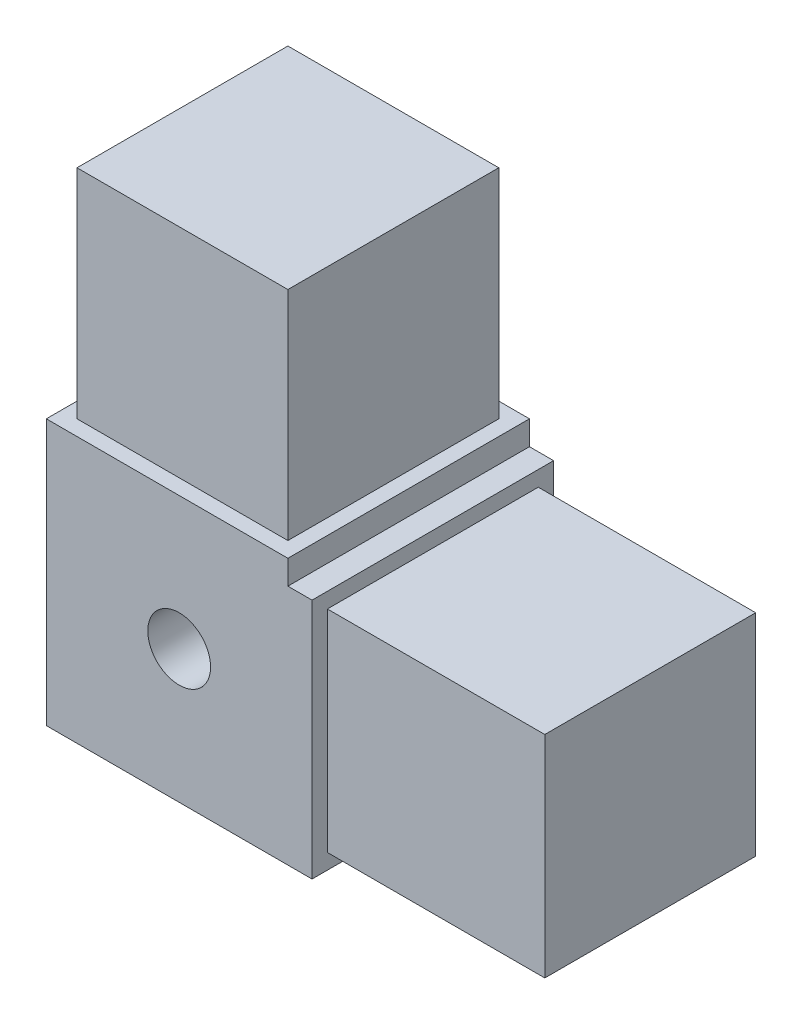
ISO-10303-21;
HEADER;
FILE_DESCRIPTION(('STEP AP214'),'2;1');
FILE_NAME('part.step','',(''),(''),'','','');
FILE_SCHEMA(('AUTOMOTIVE_DESIGN { 1 0 10303 214 1 1 1 1 }'));
ENDSEC;
DATA;
#1=APPLICATION_CONTEXT('core data for automotive mechanical design processes');
#2=APPLICATION_PROTOCOL_DEFINITION('international standard','automotive_design',2000,#1);
#3=PRODUCT_CONTEXT('',#1,'mechanical');
#4=PRODUCT('Part','Part','',(#3));
#5=PRODUCT_RELATED_PRODUCT_CATEGORY('part','',(#4));
#6=PRODUCT_DEFINITION_FORMATION('','',#4);
#7=PRODUCT_DEFINITION_CONTEXT('part definition',#1,'design');
#8=PRODUCT_DEFINITION('design','',#6,#7);
#9=PRODUCT_DEFINITION_SHAPE('','',#8);
#10=(LENGTH_UNIT() NAMED_UNIT(*) SI_UNIT(.MILLI.,.METRE.));
#11=(NAMED_UNIT(*) PLANE_ANGLE_UNIT() SI_UNIT($,.RADIAN.));
#12=(NAMED_UNIT(*) SI_UNIT($,.STERADIAN.) SOLID_ANGLE_UNIT());
#13=UNCERTAINTY_MEASURE_WITH_UNIT(LENGTH_MEASURE(1.E-05),#10,'distance_accuracy_value','');
#14=(GEOMETRIC_REPRESENTATION_CONTEXT(3) GLOBAL_UNCERTAINTY_ASSIGNED_CONTEXT((#13)) GLOBAL_UNIT_ASSIGNED_CONTEXT((#10,
#11,#12)) REPRESENTATION_CONTEXT('',''));
#15=CARTESIAN_POINT('',(0.,0.,0.));
#16=DIRECTION('',(0.,0.,1.));
#17=DIRECTION('',(1.,0.,0.));
#18=AXIS2_PLACEMENT_3D('',#15,#16,#17);
#19=CARTESIAN_POINT('',(-25.4,-25.4,-12.7));
#20=DIRECTION('',(1.,0.,0.));
#21=DIRECTION('',(0.,0.,1.));
#22=AXIS2_PLACEMENT_3D('',#19,#20,#21);
#23=PLANE('',#22);
#24=DIRECTION('',(0.,0.,-1.));
#25=VECTOR('',#24,1.);
#26=CARTESIAN_POINT('',(-25.4,2.54,-12.7));
#27=LINE('',#26,#25);
#28=CARTESIAN_POINT('',(-25.4,2.54,12.7));
#29=VERTEX_POINT('',#28);
#30=CARTESIAN_POINT('',(-25.4,2.54,-12.7));
#31=VERTEX_POINT('',#30);
#32=EDGE_CURVE('E183',#29,#31,#27,.T.);
#33=ORIENTED_EDGE('',*,*,#32,.T.);
#34=DIRECTION('',(0.,-1.,0.));
#35=VECTOR('',#34,1.);
#36=CARTESIAN_POINT('',(-25.4,-25.4,-12.7));
#37=LINE('',#36,#35);
#38=CARTESIAN_POINT('',(-25.4,-25.4,-12.7));
#39=VERTEX_POINT('',#38);
#40=EDGE_CURVE('E247',#31,#39,#37,.T.);
#41=ORIENTED_EDGE('',*,*,#40,.T.);
#42=DIRECTION('',(0.,0.,1.));
#43=VECTOR('',#42,1.);
#44=CARTESIAN_POINT('',(-25.4,-25.4,-12.7));
#45=LINE('',#44,#43);
#46=CARTESIAN_POINT('',(-25.4,-25.4,12.7));
#47=VERTEX_POINT('',#46);
#48=EDGE_CURVE('E11',#39,#47,#45,.T.);
#49=ORIENTED_EDGE('',*,*,#48,.T.);
#50=DIRECTION('',(0.,-1.,0.));
#51=VECTOR('',#50,1.);
#52=CARTESIAN_POINT('',(-25.4,-25.4,12.7));
#53=LINE('',#52,#51);
#54=EDGE_CURVE('E246',#29,#47,#53,.T.);
#55=ORIENTED_EDGE('',*,*,#54,.F.);
#56=EDGE_LOOP('',(#33,#41,#49,#55));
#57=FACE_BOUND('',#56,.T.);
#58=ADVANCED_FACE('F37',(#57),#23,.F.);
#59=CARTESIAN_POINT('',(0.,0.,-12.7));
#60=DIRECTION('',(0.,0.,1.));
#61=DIRECTION('',(-1.,0.,0.));
#62=AXIS2_PLACEMENT_3D('',#59,#60,#61);
#63=PLANE('',#62);
#64=CARTESIAN_POINT('',(-11.43,-11.43,-12.7));
#65=DIRECTION('',(0.,0.,1.));
#66=DIRECTION('',(1.,0.,0.));
#67=AXIS2_PLACEMENT_3D('',#64,#65,#66);
#68=CIRCLE('',#67,3.3);
#69=CARTESIAN_POINT('',(-8.13000000000001,-11.43,-12.7));
#70=VERTEX_POINT('',#69);
#71=EDGE_CURVE('E165',#70,#70,#68,.T.);
#72=ORIENTED_EDGE('',*,*,#71,.T.);
#73=EDGE_LOOP('',(#72));
#74=FACE_BOUND('',#73,.T.);
#75=DIRECTION('',(1.,0.,0.));
#76=VECTOR('',#75,1.);
#77=CARTESIAN_POINT('',(0.,2.54,-12.7));
#78=LINE('',#77,#76);
#79=CARTESIAN_POINT('',(0.,2.54,-12.7));
#80=VERTEX_POINT('',#79);
#81=EDGE_CURVE('E186',#31,#80,#78,.T.);
#82=ORIENTED_EDGE('',*,*,#81,.T.);
#83=DIRECTION('',(0.,-1.,0.));
#84=VECTOR('',#83,1.);
#85=CARTESIAN_POINT('',(0.,25.4,-12.7));
#86=LINE('',#85,#84);
#87=CARTESIAN_POINT('',(0.,0.,-12.7));
#88=VERTEX_POINT('',#87);
#89=EDGE_CURVE('E232',#80,#88,#86,.T.);
#90=ORIENTED_EDGE('',*,*,#89,.T.);
#91=DIRECTION('',(1.,0.,0.));
#92=VECTOR('',#91,1.);
#93=CARTESIAN_POINT('',(25.4,0.,-12.7));
#94=LINE('',#93,#92);
#95=CARTESIAN_POINT('',(2.53999999999999,0.,-12.7));
#96=VERTEX_POINT('',#95);
#97=EDGE_CURVE('E237',#88,#96,#94,.T.);
#98=ORIENTED_EDGE('',*,*,#97,.T.);
#99=DIRECTION('',(0.,-1.,0.));
#100=VECTOR('',#99,1.);
#101=CARTESIAN_POINT('',(2.53999999999999,-25.4,-12.7));
#102=LINE('',#101,#100);
#103=CARTESIAN_POINT('',(2.53999999999999,-25.4,-12.7));
#104=VERTEX_POINT('',#103);
#105=EDGE_CURVE('E214',#96,#104,#102,.T.);
#106=ORIENTED_EDGE('',*,*,#105,.T.);
#107=DIRECTION('',(1.,0.,0.));
#108=VECTOR('',#107,1.);
#109=CARTESIAN_POINT('',(-25.4,-25.4,-12.7));
#110=LINE('',#109,#108);
#111=EDGE_CURVE('E45',#39,#104,#110,.T.);
#112=ORIENTED_EDGE('',*,*,#111,.F.);
#113=ORIENTED_EDGE('',*,*,#40,.F.);
#114=EDGE_LOOP('',(#82,#90,#98,#106,#112,#113));
#115=FACE_BOUND('',#114,.T.);
#116=ADVANCED_FACE('F276',(#74,#115),#63,.F.);
#117=CARTESIAN_POINT('',(0.,0.,12.7));
#118=DIRECTION('',(0.,0.,1.));
#119=DIRECTION('',(-1.,0.,0.));
#120=AXIS2_PLACEMENT_3D('',#117,#118,#119);
#121=PLANE('',#120);
#122=CARTESIAN_POINT('',(-11.43,-11.43,12.7));
#123=DIRECTION('',(0.,0.,1.));
#124=DIRECTION('',(1.,0.,0.));
#125=AXIS2_PLACEMENT_3D('',#122,#123,#124);
#126=CIRCLE('',#125,3.3);
#127=CARTESIAN_POINT('',(-8.13000000000001,-11.43,12.7));
#128=VERTEX_POINT('',#127);
#129=EDGE_CURVE('E171',#128,#128,#126,.T.);
#130=ORIENTED_EDGE('',*,*,#129,.F.);
#131=EDGE_LOOP('',(#130));
#132=FACE_BOUND('',#131,.T.);
#133=ORIENTED_EDGE('',*,*,#54,.T.);
#134=DIRECTION('',(1.,0.,0.));
#135=VECTOR('',#134,1.);
#136=CARTESIAN_POINT('',(-25.4,-25.4,12.7));
#137=LINE('',#136,#135);
#138=CARTESIAN_POINT('',(2.53999999999999,-25.4,12.7));
#139=VERTEX_POINT('',#138);
#140=EDGE_CURVE('E250',#47,#139,#137,.T.);
#141=ORIENTED_EDGE('',*,*,#140,.T.);
#142=DIRECTION('',(0.,1.,0.));
#143=VECTOR('',#142,1.);
#144=CARTESIAN_POINT('',(2.53999999999999,-25.4,12.7));
#145=LINE('',#144,#143);
#146=CARTESIAN_POINT('',(2.53999999999999,0.,12.7));
#147=VERTEX_POINT('',#146);
#148=EDGE_CURVE('E227',#139,#147,#145,.T.);
#149=ORIENTED_EDGE('',*,*,#148,.T.);
#150=DIRECTION('',(1.,0.,0.));
#151=VECTOR('',#150,1.);
#152=CARTESIAN_POINT('',(25.4,0.,12.7));
#153=LINE('',#152,#151);
#154=CARTESIAN_POINT('',(0.,0.,12.7));
#155=VERTEX_POINT('',#154);
#156=EDGE_CURVE('E236',#155,#147,#153,.T.);
#157=ORIENTED_EDGE('',*,*,#156,.F.);
#158=DIRECTION('',(0.,-1.,0.));
#159=VECTOR('',#158,1.);
#160=CARTESIAN_POINT('',(0.,25.4,12.7));
#161=LINE('',#160,#159);
#162=CARTESIAN_POINT('',(0.,2.54,12.7));
#163=VERTEX_POINT('',#162);
#164=EDGE_CURVE('E233',#163,#155,#161,.T.);
#165=ORIENTED_EDGE('',*,*,#164,.F.);
#166=DIRECTION('',(-1.,0.,0.));
#167=VECTOR('',#166,1.);
#168=CARTESIAN_POINT('',(0.,2.54,12.7));
#169=LINE('',#168,#167);
#170=EDGE_CURVE('E181',#163,#29,#169,.T.);
#171=ORIENTED_EDGE('',*,*,#170,.T.);
#172=EDGE_LOOP('',(#133,#141,#149,#157,#165,#171));
#173=FACE_BOUND('',#172,.T.);
#174=ADVANCED_FACE('F256',(#132,#173),#121,.T.);
#175=CARTESIAN_POINT('',(0.,25.4,12.7));
#176=DIRECTION('',(-1.,0.,0.));
#177=DIRECTION('',(0.,0.,-1.));
#178=AXIS2_PLACEMENT_3D('',#175,#176,#177);
#179=PLANE('',#178);
#180=DIRECTION('',(0.,0.,1.));
#181=VECTOR('',#180,1.);
#182=CARTESIAN_POINT('',(0.,2.54,-12.7));
#183=LINE('',#182,#181);
#184=EDGE_CURVE('E60',#80,#163,#183,.T.);
#185=ORIENTED_EDGE('',*,*,#184,.T.);
#186=ORIENTED_EDGE('',*,*,#164,.T.);
#187=DIRECTION('',(0.,0.,-1.));
#188=VECTOR('',#187,1.);
#189=CARTESIAN_POINT('',(0.,0.,12.7));
#190=LINE('',#189,#188);
#191=EDGE_CURVE('E240',#155,#88,#190,.T.);
#192=ORIENTED_EDGE('',*,*,#191,.T.);
#193=ORIENTED_EDGE('',*,*,#89,.F.);
#194=EDGE_LOOP('',(#185,#186,#192,#193));
#195=FACE_BOUND('',#194,.T.);
#196=ADVANCED_FACE('F271',(#195),#179,.F.);
#197=CARTESIAN_POINT('',(-25.4,-25.4,-12.7));
#198=DIRECTION('',(0.,1.,0.));
#199=DIRECTION('',(0.,0.,-1.));
#200=AXIS2_PLACEMENT_3D('',#197,#198,#199);
#201=PLANE('',#200);
#202=ORIENTED_EDGE('',*,*,#140,.F.);
#203=ORIENTED_EDGE('',*,*,#48,.F.);
#204=ORIENTED_EDGE('',*,*,#111,.T.);
#205=DIRECTION('',(0.,0.,1.));
#206=VECTOR('',#205,1.);
#207=CARTESIAN_POINT('',(2.53999999999999,-25.4,-12.7));
#208=LINE('',#207,#206);
#209=EDGE_CURVE('E225',#104,#139,#208,.T.);
#210=ORIENTED_EDGE('',*,*,#209,.T.);
#211=EDGE_LOOP('',(#202,#203,#204,#210));
#212=FACE_BOUND('',#211,.T.);
#213=ADVANCED_FACE('F262',(#212),#201,.F.);
#214=CARTESIAN_POINT('',(25.4,0.,12.7));
#215=DIRECTION('',(0.,-1.,0.));
#216=DIRECTION('',(0.,0.,1.));
#217=AXIS2_PLACEMENT_3D('',#214,#215,#216);
#218=PLANE('',#217);
#219=ORIENTED_EDGE('',*,*,#97,.F.);
#220=ORIENTED_EDGE('',*,*,#191,.F.);
#221=ORIENTED_EDGE('',*,*,#156,.T.);
#222=DIRECTION('',(0.,0.,-1.));
#223=VECTOR('',#222,1.);
#224=CARTESIAN_POINT('',(2.53999999999999,0.,-12.7));
#225=LINE('',#224,#223);
#226=EDGE_CURVE('E230',#147,#96,#225,.T.);
#227=ORIENTED_EDGE('',*,*,#226,.T.);
#228=EDGE_LOOP('',(#219,#220,#221,#227));
#229=FACE_BOUND('',#228,.T.);
#230=ADVANCED_FACE('F268',(#229),#218,.F.);
#231=CARTESIAN_POINT('',(2.53999999999999,0.,0.));
#232=DIRECTION('',(-1.,0.,0.));
#233=DIRECTION('',(0.,0.,-1.));
#234=AXIS2_PLACEMENT_3D('',#231,#232,#233);
#235=PLANE('',#234);
#236=DIRECTION('',(0.,0.,1.));
#237=VECTOR('',#236,1.);
#238=CARTESIAN_POINT('',(2.53999999999999,-23.7871,-11.0871));
#239=LINE('',#238,#237);
#240=CARTESIAN_POINT('',(2.53999999999999,-23.7871,-11.0871));
#241=VERTEX_POINT('',#240);
#242=CARTESIAN_POINT('',(2.53999999999999,-23.7871,11.0871));
#243=VERTEX_POINT('',#242);
#244=EDGE_CURVE('E190',#241,#243,#239,.T.);
#245=ORIENTED_EDGE('',*,*,#244,.T.);
#246=DIRECTION('',(0.,1.,0.));
#247=VECTOR('',#246,1.);
#248=CARTESIAN_POINT('',(2.53999999999999,-23.7871,11.0871));
#249=LINE('',#248,#247);
#250=CARTESIAN_POINT('',(2.53999999999999,-1.6129,11.0871));
#251=VERTEX_POINT('',#250);
#252=EDGE_CURVE('E193',#243,#251,#249,.T.);
#253=ORIENTED_EDGE('',*,*,#252,.T.);
#254=DIRECTION('',(0.,0.,-1.));
#255=VECTOR('',#254,1.);
#256=CARTESIAN_POINT('',(2.53999999999999,-1.6129,-11.0871));
#257=LINE('',#256,#255);
#258=CARTESIAN_POINT('',(2.53999999999999,-1.6129,-11.0871));
#259=VERTEX_POINT('',#258);
#260=EDGE_CURVE('E197',#251,#259,#257,.T.);
#261=ORIENTED_EDGE('',*,*,#260,.T.);
#262=DIRECTION('',(0.,-1.,0.));
#263=VECTOR('',#262,1.);
#264=CARTESIAN_POINT('',(2.53999999999999,-23.7871,-11.0871));
#265=LINE('',#264,#263);
#266=EDGE_CURVE('E200',#259,#241,#265,.T.);
#267=ORIENTED_EDGE('',*,*,#266,.T.);
#268=EDGE_LOOP('',(#245,#253,#261,#267));
#269=FACE_BOUND('',#268,.T.);
#270=ORIENTED_EDGE('',*,*,#105,.F.);
#271=ORIENTED_EDGE('',*,*,#226,.F.);
#272=ORIENTED_EDGE('',*,*,#148,.F.);
#273=ORIENTED_EDGE('',*,*,#209,.F.);
#274=EDGE_LOOP('',(#270,#271,#272,#273));
#275=FACE_BOUND('',#274,.T.);
#276=ADVANCED_FACE('F265',(#269,#275),#235,.F.);
#277=CARTESIAN_POINT('',(2.53999999999999,-23.7871,-11.0871));
#278=DIRECTION('',(0.,-1.,0.));
#279=DIRECTION('',(0.,0.,1.));
#280=AXIS2_PLACEMENT_3D('',#277,#278,#279);
#281=PLANE('',#280);
#282=DIRECTION('',(0.,0.,1.));
#283=VECTOR('',#282,1.);
#284=CARTESIAN_POINT('',(25.4,-23.7871,-11.0871));
#285=LINE('',#284,#283);
#286=CARTESIAN_POINT('',(25.4,-23.7871,-11.0871));
#287=VERTEX_POINT('',#286);
#288=CARTESIAN_POINT('',(25.4,-23.7871,11.0871));
#289=VERTEX_POINT('',#288);
#290=EDGE_CURVE('E189',#287,#289,#285,.T.);
#291=ORIENTED_EDGE('',*,*,#290,.T.);
#292=DIRECTION('',(1.,0.,0.));
#293=VECTOR('',#292,1.);
#294=CARTESIAN_POINT('',(2.53999999999999,-23.7871,11.0871));
#295=LINE('',#294,#293);
#296=EDGE_CURVE('E203',#243,#289,#295,.T.);
#297=ORIENTED_EDGE('',*,*,#296,.F.);
#298=ORIENTED_EDGE('',*,*,#244,.F.);
#299=DIRECTION('',(1.,0.,0.));
#300=VECTOR('',#299,1.);
#301=CARTESIAN_POINT('',(2.53999999999999,-23.7871,-11.0871));
#302=LINE('',#301,#300);
#303=EDGE_CURVE('E211',#241,#287,#302,.T.);
#304=ORIENTED_EDGE('',*,*,#303,.T.);
#305=EDGE_LOOP('',(#291,#297,#298,#304));
#306=FACE_BOUND('',#305,.T.);
#307=ADVANCED_FACE('F324',(#306),#281,.T.);
#308=CARTESIAN_POINT('',(2.53999999999999,-23.7871,-11.0871));
#309=DIRECTION('',(0.,0.,-1.));
#310=DIRECTION('',(1.,0.,0.));
#311=AXIS2_PLACEMENT_3D('',#308,#309,#310);
#312=PLANE('',#311);
#313=DIRECTION('',(0.,-1.,0.));
#314=VECTOR('',#313,1.);
#315=CARTESIAN_POINT('',(25.4,-23.7871,-11.0871));
#316=LINE('',#315,#314);
#317=CARTESIAN_POINT('',(25.4,-1.6129,-11.0871));
#318=VERTEX_POINT('',#317);
#319=EDGE_CURVE('E194',#318,#287,#316,.T.);
#320=ORIENTED_EDGE('',*,*,#319,.T.);
#321=ORIENTED_EDGE('',*,*,#303,.F.);
#322=ORIENTED_EDGE('',*,*,#266,.F.);
#323=DIRECTION('',(1.,0.,0.));
#324=VECTOR('',#323,1.);
#325=CARTESIAN_POINT('',(2.53999999999999,-1.6129,-11.0871));
#326=LINE('',#325,#324);
#327=EDGE_CURVE('E215',#259,#318,#326,.T.);
#328=ORIENTED_EDGE('',*,*,#327,.T.);
#329=EDGE_LOOP('',(#320,#321,#322,#328));
#330=FACE_BOUND('',#329,.T.);
#331=ADVANCED_FACE('F320',(#330),#312,.T.);
#332=CARTESIAN_POINT('',(2.53999999999999,-1.6129,-11.0871));
#333=DIRECTION('',(0.,1.,0.));
#334=DIRECTION('',(0.,0.,-1.));
#335=AXIS2_PLACEMENT_3D('',#332,#333,#334);
#336=PLANE('',#335);
#337=DIRECTION('',(0.,0.,-1.));
#338=VECTOR('',#337,1.);
#339=CARTESIAN_POINT('',(25.4,-1.6129,-11.0871));
#340=LINE('',#339,#338);
#341=CARTESIAN_POINT('',(25.4,-1.6129,11.0871));
#342=VERTEX_POINT('',#341);
#343=EDGE_CURVE('E208',#342,#318,#340,.T.);
#344=ORIENTED_EDGE('',*,*,#343,.T.);
#345=ORIENTED_EDGE('',*,*,#327,.F.);
#346=ORIENTED_EDGE('',*,*,#260,.F.);
#347=DIRECTION('',(1.,0.,0.));
#348=VECTOR('',#347,1.);
#349=CARTESIAN_POINT('',(2.53999999999999,-1.6129,11.0871));
#350=LINE('',#349,#348);
#351=EDGE_CURVE('E218',#251,#342,#350,.T.);
#352=ORIENTED_EDGE('',*,*,#351,.T.);
#353=EDGE_LOOP('',(#344,#345,#346,#352));
#354=FACE_BOUND('',#353,.T.);
#355=ADVANCED_FACE('F323',(#354),#336,.T.);
#356=CARTESIAN_POINT('',(2.53999999999999,-23.7871,11.0871));
#357=DIRECTION('',(0.,0.,1.));
#358=DIRECTION('',(-1.,0.,0.));
#359=AXIS2_PLACEMENT_3D('',#356,#357,#358);
#360=PLANE('',#359);
#361=DIRECTION('',(0.,1.,0.));
#362=VECTOR('',#361,1.);
#363=CARTESIAN_POINT('',(25.4,-23.7871,11.0871));
#364=LINE('',#363,#362);
#365=EDGE_CURVE('E206',#289,#342,#364,.T.);
#366=ORIENTED_EDGE('',*,*,#365,.T.);
#367=ORIENTED_EDGE('',*,*,#351,.F.);
#368=ORIENTED_EDGE('',*,*,#252,.F.);
#369=ORIENTED_EDGE('',*,*,#296,.T.);
#370=EDGE_LOOP('',(#366,#367,#368,#369));
#371=FACE_BOUND('',#370,.T.);
#372=ADVANCED_FACE('F328',(#371),#360,.T.);
#373=CARTESIAN_POINT('',(25.4,-25.4,-12.7));
#374=DIRECTION('',(-1.,0.,0.));
#375=DIRECTION('',(0.,0.,-1.));
#376=AXIS2_PLACEMENT_3D('',#373,#374,#375);
#377=PLANE('',#376);
#378=ORIENTED_EDGE('',*,*,#290,.F.);
#379=ORIENTED_EDGE('',*,*,#319,.F.);
#380=ORIENTED_EDGE('',*,*,#343,.F.);
#381=ORIENTED_EDGE('',*,*,#365,.F.);
#382=EDGE_LOOP('',(#378,#379,#380,#381));
#383=FACE_BOUND('',#382,.T.);
#384=ADVANCED_FACE('F39',(#383),#377,.F.);
#385=CARTESIAN_POINT('',(0.,2.54,0.));
#386=DIRECTION('',(0.,1.,0.));
#387=DIRECTION('',(0.,0.,-1.));
#388=AXIS2_PLACEMENT_3D('',#385,#386,#387);
#389=PLANE('',#388);
#390=DIRECTION('',(1.,0.,0.));
#391=VECTOR('',#390,1.);
#392=CARTESIAN_POINT('',(-1.6129,2.54,-11.0871));
#393=LINE('',#392,#391);
#394=CARTESIAN_POINT('',(-23.7871,2.54,-11.0871));
#395=VERTEX_POINT('',#394);
#396=CARTESIAN_POINT('',(-1.6129,2.54,-11.0871));
#397=VERTEX_POINT('',#396);
#398=EDGE_CURVE('E148',#395,#397,#393,.T.);
#399=ORIENTED_EDGE('',*,*,#398,.T.);
#400=DIRECTION('',(0.,0.,1.));
#401=VECTOR('',#400,1.);
#402=CARTESIAN_POINT('',(-1.6129,2.54,-11.0871));
#403=LINE('',#402,#401);
#404=CARTESIAN_POINT('',(-1.6129,2.54,11.0871));
#405=VERTEX_POINT('',#404);
#406=EDGE_CURVE('E143',#397,#405,#403,.T.);
#407=ORIENTED_EDGE('',*,*,#406,.T.);
#408=DIRECTION('',(-1.,0.,0.));
#409=VECTOR('',#408,1.);
#410=CARTESIAN_POINT('',(-1.6129,2.54,11.0871));
#411=LINE('',#410,#409);
#412=CARTESIAN_POINT('',(-23.7871,2.54,11.0871));
#413=VERTEX_POINT('',#412);
#414=EDGE_CURVE('E151',#405,#413,#411,.T.);
#415=ORIENTED_EDGE('',*,*,#414,.T.);
#416=DIRECTION('',(0.,0.,-1.));
#417=VECTOR('',#416,1.);
#418=CARTESIAN_POINT('',(-23.7871,2.54,-11.0871));
#419=LINE('',#418,#417);
#420=EDGE_CURVE('E156',#413,#395,#419,.T.);
#421=ORIENTED_EDGE('',*,*,#420,.T.);
#422=EDGE_LOOP('',(#399,#407,#415,#421));
#423=FACE_BOUND('',#422,.T.);
#424=ORIENTED_EDGE('',*,*,#184,.F.);
#425=ORIENTED_EDGE('',*,*,#81,.F.);
#426=ORIENTED_EDGE('',*,*,#32,.F.);
#427=ORIENTED_EDGE('',*,*,#170,.F.);
#428=EDGE_LOOP('',(#424,#425,#426,#427));
#429=FACE_BOUND('',#428,.T.);
#430=ADVANCED_FACE('F158',(#423,#429),#389,.T.);
#431=CARTESIAN_POINT('',(-1.6129,2.54,-11.0871));
#432=DIRECTION('',(1.,0.,0.));
#433=DIRECTION('',(0.,0.,1.));
#434=AXIS2_PLACEMENT_3D('',#431,#432,#433);
#435=PLANE('',#434);
#436=DIRECTION('',(0.,0.,1.));
#437=VECTOR('',#436,1.);
#438=CARTESIAN_POINT('',(-1.6129,25.4,-11.0871));
#439=LINE('',#438,#437);
#440=CARTESIAN_POINT('',(-1.6129,25.4,-11.0871));
#441=VERTEX_POINT('',#440);
#442=CARTESIAN_POINT('',(-1.6129,25.4,11.0871));
#443=VERTEX_POINT('',#442);
#444=EDGE_CURVE('E146',#441,#443,#439,.T.);
#445=ORIENTED_EDGE('',*,*,#444,.T.);
#446=DIRECTION('',(0.,1.,0.));
#447=VECTOR('',#446,1.);
#448=CARTESIAN_POINT('',(-1.6129,2.54,11.0871));
#449=LINE('',#448,#447);
#450=EDGE_CURVE('E138',#405,#443,#449,.T.);
#451=ORIENTED_EDGE('',*,*,#450,.F.);
#452=ORIENTED_EDGE('',*,*,#406,.F.);
#453=DIRECTION('',(0.,1.,0.));
#454=VECTOR('',#453,1.);
#455=CARTESIAN_POINT('',(-1.6129,2.54,-11.0871));
#456=LINE('',#455,#454);
#457=EDGE_CURVE('E174',#397,#441,#456,.T.);
#458=ORIENTED_EDGE('',*,*,#457,.T.);
#459=EDGE_LOOP('',(#445,#451,#452,#458));
#460=FACE_BOUND('',#459,.T.);
#461=ADVANCED_FACE('F140',(#460),#435,.T.);
#462=CARTESIAN_POINT('',(-1.6129,2.54,-11.0871));
#463=DIRECTION('',(0.,0.,-1.));
#464=DIRECTION('',(1.,0.,0.));
#465=AXIS2_PLACEMENT_3D('',#462,#463,#464);
#466=PLANE('',#465);
#467=DIRECTION('',(1.,0.,0.));
#468=VECTOR('',#467,1.);
#469=CARTESIAN_POINT('',(-1.6129,25.4,-11.0871));
#470=LINE('',#469,#468);
#471=CARTESIAN_POINT('',(-23.7871,25.4,-11.0871));
#472=VERTEX_POINT('',#471);
#473=EDGE_CURVE('E160',#472,#441,#470,.T.);
#474=ORIENTED_EDGE('',*,*,#473,.T.);
#475=ORIENTED_EDGE('',*,*,#457,.F.);
#476=ORIENTED_EDGE('',*,*,#398,.F.);
#477=DIRECTION('',(0.,1.,0.));
#478=VECTOR('',#477,1.);
#479=CARTESIAN_POINT('',(-23.7871,2.54,-11.0871));
#480=LINE('',#479,#478);
#481=EDGE_CURVE('E176',#395,#472,#480,.T.);
#482=ORIENTED_EDGE('',*,*,#481,.T.);
#483=EDGE_LOOP('',(#474,#475,#476,#482));
#484=FACE_BOUND('',#483,.T.);
#485=ADVANCED_FACE('F308',(#484),#466,.T.);
#486=CARTESIAN_POINT('',(-23.7871,2.54,-11.0871));
#487=DIRECTION('',(-1.,0.,0.));
#488=DIRECTION('',(0.,0.,-1.));
#489=AXIS2_PLACEMENT_3D('',#486,#487,#488);
#490=PLANE('',#489);
#491=DIRECTION('',(0.,0.,-1.));
#492=VECTOR('',#491,1.);
#493=CARTESIAN_POINT('',(-23.7871,25.4,-11.0871));
#494=LINE('',#493,#492);
#495=CARTESIAN_POINT('',(-23.7871,25.4,11.0871));
#496=VERTEX_POINT('',#495);
#497=EDGE_CURVE('E162',#496,#472,#494,.T.);
#498=ORIENTED_EDGE('',*,*,#497,.T.);
#499=ORIENTED_EDGE('',*,*,#481,.F.);
#500=ORIENTED_EDGE('',*,*,#420,.F.);
#501=DIRECTION('',(0.,1.,0.));
#502=VECTOR('',#501,1.);
#503=CARTESIAN_POINT('',(-23.7871,2.54,11.0871));
#504=LINE('',#503,#502);
#505=EDGE_CURVE('E147',#413,#496,#504,.T.);
#506=ORIENTED_EDGE('',*,*,#505,.T.);
#507=EDGE_LOOP('',(#498,#499,#500,#506));
#508=FACE_BOUND('',#507,.T.);
#509=ADVANCED_FACE('F302',(#508),#490,.T.);
#510=CARTESIAN_POINT('',(-1.6129,2.54,11.0871));
#511=DIRECTION('',(0.,0.,1.));
#512=DIRECTION('',(-1.,0.,0.));
#513=AXIS2_PLACEMENT_3D('',#510,#511,#512);
#514=PLANE('',#513);
#515=DIRECTION('',(-1.,0.,0.));
#516=VECTOR('',#515,1.);
#517=CARTESIAN_POINT('',(-1.6129,25.4,11.0871));
#518=LINE('',#517,#516);
#519=EDGE_CURVE('E52',#443,#496,#518,.T.);
#520=ORIENTED_EDGE('',*,*,#519,.T.);
#521=ORIENTED_EDGE('',*,*,#505,.F.);
#522=ORIENTED_EDGE('',*,*,#414,.F.);
#523=ORIENTED_EDGE('',*,*,#450,.T.);
#524=EDGE_LOOP('',(#520,#521,#522,#523));
#525=FACE_BOUND('',#524,.T.);
#526=ADVANCED_FACE('F152',(#525),#514,.T.);
#527=CARTESIAN_POINT('',(-25.4,25.4,-12.7));
#528=DIRECTION('',(0.,-1.,0.));
#529=DIRECTION('',(0.,0.,1.));
#530=AXIS2_PLACEMENT_3D('',#527,#528,#529);
#531=PLANE('',#530);
#532=ORIENTED_EDGE('',*,*,#444,.F.);
#533=ORIENTED_EDGE('',*,*,#473,.F.);
#534=ORIENTED_EDGE('',*,*,#497,.F.);
#535=ORIENTED_EDGE('',*,*,#519,.F.);
#536=EDGE_LOOP('',(#532,#533,#534,#535));
#537=FACE_BOUND('',#536,.T.);
#538=ADVANCED_FACE('F292',(#537),#531,.F.);
#539=CARTESIAN_POINT('',(-11.43,-11.43,12.7));
#540=DIRECTION('',(0.,0.,-1.));
#541=DIRECTION('',(1.,0.,0.));
#542=AXIS2_PLACEMENT_3D('',#539,#540,#541);
#543=CYLINDRICAL_SURFACE('',#542,3.3);
#544=ORIENTED_EDGE('',*,*,#129,.T.);
#545=EDGE_LOOP('',(#544));
#546=FACE_BOUND('',#545,.T.);
#547=ORIENTED_EDGE('',*,*,#71,.F.);
#548=EDGE_LOOP('',(#547));
#549=FACE_BOUND('',#548,.T.);
#550=ADVANCED_FACE('F294',(#546,#549),#543,.F.);
#551=CLOSED_SHELL('',(#58,#116,#174,#196,#213,#230,#276,#307,#331,#355,#372,#384,#430,#461,#485,
#509,#526,#538,#550));
#552=MANIFOLD_SOLID_BREP('B2',#551);
#553=ADVANCED_BREP_SHAPE_REPRESENTATION('',(#18,#552),#14);
#554=SHAPE_DEFINITION_REPRESENTATION(#9,#553);
ENDSEC;
END-ISO-10303-21;
